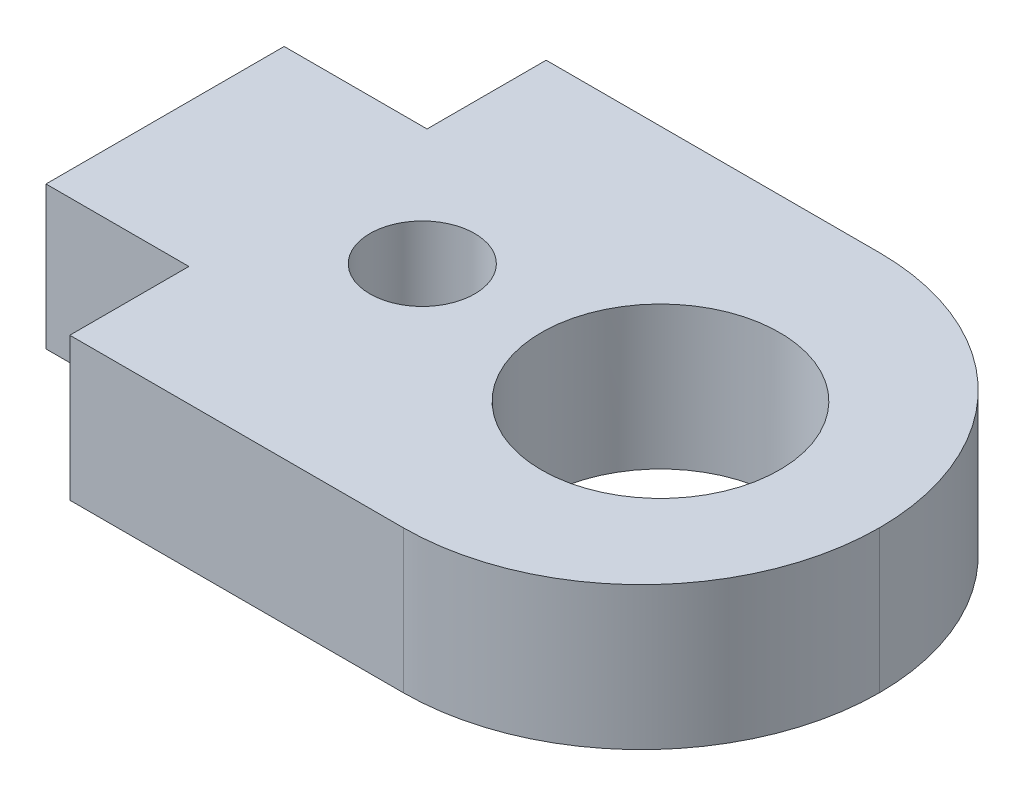
ISO-10303-21;
HEADER;
FILE_DESCRIPTION(('STEP AP214'),'2;1');
FILE_NAME('part.step','',(''),(''),'','','');
FILE_SCHEMA(('AUTOMOTIVE_DESIGN { 1 0 10303 214 1 1 1 1 }'));
ENDSEC;
DATA;
#1=APPLICATION_CONTEXT('core data for automotive mechanical design processes');
#2=APPLICATION_PROTOCOL_DEFINITION('international standard','automotive_design',2000,#1);
#3=PRODUCT_CONTEXT('',#1,'mechanical');
#4=PRODUCT('Part','Part','',(#3));
#5=PRODUCT_RELATED_PRODUCT_CATEGORY('part','',(#4));
#6=PRODUCT_DEFINITION_FORMATION('','',#4);
#7=PRODUCT_DEFINITION_CONTEXT('part definition',#1,'design');
#8=PRODUCT_DEFINITION('design','',#6,#7);
#9=PRODUCT_DEFINITION_SHAPE('','',#8);
#10=(LENGTH_UNIT() NAMED_UNIT(*) SI_UNIT(.MILLI.,.METRE.));
#11=(NAMED_UNIT(*) PLANE_ANGLE_UNIT() SI_UNIT($,.RADIAN.));
#12=(NAMED_UNIT(*) SI_UNIT($,.STERADIAN.) SOLID_ANGLE_UNIT());
#13=UNCERTAINTY_MEASURE_WITH_UNIT(LENGTH_MEASURE(1.E-05),#10,'distance_accuracy_value','');
#14=(GEOMETRIC_REPRESENTATION_CONTEXT(3) GLOBAL_UNCERTAINTY_ASSIGNED_CONTEXT((#13)) GLOBAL_UNIT_ASSIGNED_CONTEXT((#10,
#11,#12)) REPRESENTATION_CONTEXT('',''));
#15=CARTESIAN_POINT('',(0.,0.,0.));
#16=DIRECTION('',(0.,0.,1.));
#17=DIRECTION('',(1.,0.,0.));
#18=AXIS2_PLACEMENT_3D('',#15,#16,#17);
#19=CARTESIAN_POINT('',(-6.,3.,-5.));
#20=DIRECTION('',(0.,0.,1.));
#21=DIRECTION('',(1.,0.,0.));
#22=AXIS2_PLACEMENT_3D('',#19,#20,#21);
#23=PLANE('',#22);
#24=DIRECTION('',(-1.,0.,0.));
#25=VECTOR('',#24,1.);
#26=CARTESIAN_POINT('',(-6.,3.,-5.));
#27=LINE('',#26,#25);
#28=CARTESIAN_POINT('',(0.999999999999997,3.,-5.));
#29=VERTEX_POINT('',#28);
#30=CARTESIAN_POINT('',(-6.,3.,-5.));
#31=VERTEX_POINT('',#30);
#32=EDGE_CURVE('E107',#29,#31,#27,.T.);
#33=ORIENTED_EDGE('',*,*,#32,.F.);
#34=DIRECTION('',(0.,-1.,0.));
#35=VECTOR('',#34,1.);
#36=CARTESIAN_POINT('',(0.999999999999997,3.,-5.));
#37=LINE('',#36,#35);
#38=CARTESIAN_POINT('',(0.999999999999997,0.,-5.));
#39=VERTEX_POINT('',#38);
#40=EDGE_CURVE('E125',#29,#39,#37,.T.);
#41=ORIENTED_EDGE('',*,*,#40,.T.);
#42=DIRECTION('',(-1.,0.,0.));
#43=VECTOR('',#42,1.);
#44=CARTESIAN_POINT('',(-6.,0.,-5.));
#45=LINE('',#44,#43);
#46=CARTESIAN_POINT('',(-6.,0.,-5.));
#47=VERTEX_POINT('',#46);
#48=EDGE_CURVE('E122',#39,#47,#45,.T.);
#49=ORIENTED_EDGE('',*,*,#48,.T.);
#50=DIRECTION('',(0.,-1.,0.));
#51=VECTOR('',#50,1.);
#52=CARTESIAN_POINT('',(-6.,3.,-5.));
#53=LINE('',#52,#51);
#54=EDGE_CURVE('E120',#31,#47,#53,.T.);
#55=ORIENTED_EDGE('',*,*,#54,.F.);
#56=EDGE_LOOP('',(#33,#41,#49,#55));
#57=FACE_BOUND('',#56,.T.);
#58=ADVANCED_FACE('F37',(#57),#23,.F.);
#59=CARTESIAN_POINT('',(-6.,3.,-5.));
#60=DIRECTION('',(1.,0.,0.));
#61=DIRECTION('',(0.,0.,-1.));
#62=AXIS2_PLACEMENT_3D('',#59,#60,#61);
#63=PLANE('',#62);
#64=DIRECTION('',(0.,0.,1.));
#65=VECTOR('',#64,1.);
#66=CARTESIAN_POINT('',(-6.,0.,-5.));
#67=LINE('',#66,#65);
#68=CARTESIAN_POINT('',(-6.,0.,-2.5));
#69=VERTEX_POINT('',#68);
#70=EDGE_CURVE('E146',#47,#69,#67,.T.);
#71=ORIENTED_EDGE('',*,*,#70,.T.);
#72=DIRECTION('',(0.,-1.,0.));
#73=VECTOR('',#72,1.);
#74=CARTESIAN_POINT('',(-6.,3.,-2.5));
#75=LINE('',#74,#73);
#76=CARTESIAN_POINT('',(-6.,3.,-2.5));
#77=VERTEX_POINT('',#76);
#78=EDGE_CURVE('E126',#77,#69,#75,.T.);
#79=ORIENTED_EDGE('',*,*,#78,.F.);
#80=DIRECTION('',(0.,0.,1.));
#81=VECTOR('',#80,1.);
#82=CARTESIAN_POINT('',(-6.,3.,-5.));
#83=LINE('',#82,#81);
#84=EDGE_CURVE('E111',#31,#77,#83,.T.);
#85=ORIENTED_EDGE('',*,*,#84,.F.);
#86=ORIENTED_EDGE('',*,*,#54,.T.);
#87=EDGE_LOOP('',(#71,#79,#85,#86));
#88=FACE_BOUND('',#87,.T.);
#89=ADVANCED_FACE('F128',(#88),#63,.F.);
#90=CARTESIAN_POINT('',(-6.,3.,-2.5));
#91=DIRECTION('',(0.,0.,1.));
#92=DIRECTION('',(1.,0.,0.));
#93=AXIS2_PLACEMENT_3D('',#90,#91,#92);
#94=PLANE('',#93);
#95=DIRECTION('',(-1.,0.,0.));
#96=VECTOR('',#95,1.);
#97=CARTESIAN_POINT('',(-6.,0.,-2.5));
#98=LINE('',#97,#96);
#99=CARTESIAN_POINT('',(-9.,0.,-2.5));
#100=VERTEX_POINT('',#99);
#101=EDGE_CURVE('E149',#69,#100,#98,.T.);
#102=ORIENTED_EDGE('',*,*,#101,.T.);
#103=DIRECTION('',(0.,-1.,0.));
#104=VECTOR('',#103,1.);
#105=CARTESIAN_POINT('',(-9.,3.,-2.5));
#106=LINE('',#105,#104);
#107=CARTESIAN_POINT('',(-9.,3.,-2.5));
#108=VERTEX_POINT('',#107);
#109=EDGE_CURVE('E166',#108,#100,#106,.T.);
#110=ORIENTED_EDGE('',*,*,#109,.F.);
#111=DIRECTION('',(-1.,0.,0.));
#112=VECTOR('',#111,1.);
#113=CARTESIAN_POINT('',(-6.,3.,-2.5));
#114=LINE('',#113,#112);
#115=EDGE_CURVE('E131',#77,#108,#114,.T.);
#116=ORIENTED_EDGE('',*,*,#115,.F.);
#117=ORIENTED_EDGE('',*,*,#78,.T.);
#118=EDGE_LOOP('',(#102,#110,#116,#117));
#119=FACE_BOUND('',#118,.T.);
#120=ADVANCED_FACE('F219',(#119),#94,.F.);
#121=CARTESIAN_POINT('',(-9.,3.,-2.5));
#122=DIRECTION('',(1.,0.,0.));
#123=DIRECTION('',(0.,0.,-1.));
#124=AXIS2_PLACEMENT_3D('',#121,#122,#123);
#125=PLANE('',#124);
#126=DIRECTION('',(0.,0.,1.));
#127=VECTOR('',#126,1.);
#128=CARTESIAN_POINT('',(-9.,0.,-2.5));
#129=LINE('',#128,#127);
#130=CARTESIAN_POINT('',(-9.,0.,2.5));
#131=VERTEX_POINT('',#130);
#132=EDGE_CURVE('E151',#100,#131,#129,.T.);
#133=ORIENTED_EDGE('',*,*,#132,.T.);
#134=DIRECTION('',(0.,-1.,0.));
#135=VECTOR('',#134,1.);
#136=CARTESIAN_POINT('',(-9.,3.,2.5));
#137=LINE('',#136,#135);
#138=CARTESIAN_POINT('',(-9.,3.,2.5));
#139=VERTEX_POINT('',#138);
#140=EDGE_CURVE('E163',#139,#131,#137,.T.);
#141=ORIENTED_EDGE('',*,*,#140,.F.);
#142=DIRECTION('',(0.,0.,1.));
#143=VECTOR('',#142,1.);
#144=CARTESIAN_POINT('',(-9.,3.,-2.5));
#145=LINE('',#144,#143);
#146=EDGE_CURVE('E133',#108,#139,#145,.T.);
#147=ORIENTED_EDGE('',*,*,#146,.F.);
#148=ORIENTED_EDGE('',*,*,#109,.T.);
#149=EDGE_LOOP('',(#133,#141,#147,#148));
#150=FACE_BOUND('',#149,.T.);
#151=ADVANCED_FACE('F298',(#150),#125,.F.);
#152=CARTESIAN_POINT('',(-9.,3.,2.5));
#153=DIRECTION('',(0.,0.,-1.));
#154=DIRECTION('',(-1.,0.,0.));
#155=AXIS2_PLACEMENT_3D('',#152,#153,#154);
#156=PLANE('',#155);
#157=DIRECTION('',(1.,0.,0.));
#158=VECTOR('',#157,1.);
#159=CARTESIAN_POINT('',(-9.,0.,2.5));
#160=LINE('',#159,#158);
#161=CARTESIAN_POINT('',(-6.,0.,2.5));
#162=VERTEX_POINT('',#161);
#163=EDGE_CURVE('E153',#131,#162,#160,.T.);
#164=ORIENTED_EDGE('',*,*,#163,.T.);
#165=DIRECTION('',(0.,-1.,0.));
#166=VECTOR('',#165,1.);
#167=CARTESIAN_POINT('',(-6.,3.,2.5));
#168=LINE('',#167,#166);
#169=CARTESIAN_POINT('',(-6.,3.,2.5));
#170=VERTEX_POINT('',#169);
#171=EDGE_CURVE('E160',#170,#162,#168,.T.);
#172=ORIENTED_EDGE('',*,*,#171,.F.);
#173=DIRECTION('',(1.,0.,0.));
#174=VECTOR('',#173,1.);
#175=CARTESIAN_POINT('',(-9.,3.,2.5));
#176=LINE('',#175,#174);
#177=EDGE_CURVE('E138',#139,#170,#176,.T.);
#178=ORIENTED_EDGE('',*,*,#177,.F.);
#179=ORIENTED_EDGE('',*,*,#140,.T.);
#180=EDGE_LOOP('',(#164,#172,#178,#179));
#181=FACE_BOUND('',#180,.T.);
#182=ADVANCED_FACE('F289',(#181),#156,.F.);
#183=CARTESIAN_POINT('',(-6.,3.,2.5));
#184=DIRECTION('',(1.,0.,0.));
#185=DIRECTION('',(0.,0.,-1.));
#186=AXIS2_PLACEMENT_3D('',#183,#184,#185);
#187=PLANE('',#186);
#188=DIRECTION('',(0.,0.,1.));
#189=VECTOR('',#188,1.);
#190=CARTESIAN_POINT('',(-6.,0.,2.5));
#191=LINE('',#190,#189);
#192=CARTESIAN_POINT('',(-6.,0.,5.));
#193=VERTEX_POINT('',#192);
#194=EDGE_CURVE('E155',#162,#193,#191,.T.);
#195=ORIENTED_EDGE('',*,*,#194,.T.);
#196=DIRECTION('',(0.,-1.,0.));
#197=VECTOR('',#196,1.);
#198=CARTESIAN_POINT('',(-6.,3.,5.));
#199=LINE('',#198,#197);
#200=CARTESIAN_POINT('',(-6.,3.,5.));
#201=VERTEX_POINT('',#200);
#202=EDGE_CURVE('E144',#201,#193,#199,.T.);
#203=ORIENTED_EDGE('',*,*,#202,.F.);
#204=DIRECTION('',(0.,0.,1.));
#205=VECTOR('',#204,1.);
#206=CARTESIAN_POINT('',(-6.,3.,2.5));
#207=LINE('',#206,#205);
#208=EDGE_CURVE('E140',#170,#201,#207,.T.);
#209=ORIENTED_EDGE('',*,*,#208,.F.);
#210=ORIENTED_EDGE('',*,*,#171,.T.);
#211=EDGE_LOOP('',(#195,#203,#209,#210));
#212=FACE_BOUND('',#211,.T.);
#213=ADVANCED_FACE('F211',(#212),#187,.F.);
#214=CARTESIAN_POINT('',(-6.,3.,5.));
#215=DIRECTION('',(0.,0.,-1.));
#216=DIRECTION('',(-1.,0.,0.));
#217=AXIS2_PLACEMENT_3D('',#214,#215,#216);
#218=PLANE('',#217);
#219=DIRECTION('',(1.,0.,0.));
#220=VECTOR('',#219,1.);
#221=CARTESIAN_POINT('',(-6.,0.,5.));
#222=LINE('',#221,#220);
#223=CARTESIAN_POINT('',(0.999999999999997,0.,5.));
#224=VERTEX_POINT('',#223);
#225=EDGE_CURVE('E117',#193,#224,#222,.T.);
#226=ORIENTED_EDGE('',*,*,#225,.T.);
#227=DIRECTION('',(0.,-1.,0.));
#228=VECTOR('',#227,1.);
#229=CARTESIAN_POINT('',(0.999999999999997,3.,5.));
#230=LINE('',#229,#228);
#231=CARTESIAN_POINT('',(0.999999999999997,3.,5.));
#232=VERTEX_POINT('',#231);
#233=EDGE_CURVE('E11',#224,#232,#230,.F.);
#234=ORIENTED_EDGE('',*,*,#233,.T.);
#235=DIRECTION('',(1.,0.,0.));
#236=VECTOR('',#235,1.);
#237=CARTESIAN_POINT('',(-6.,3.,5.));
#238=LINE('',#237,#236);
#239=EDGE_CURVE('E142',#201,#232,#238,.T.);
#240=ORIENTED_EDGE('',*,*,#239,.F.);
#241=ORIENTED_EDGE('',*,*,#202,.T.);
#242=EDGE_LOOP('',(#226,#234,#240,#241));
#243=FACE_BOUND('',#242,.T.);
#244=ADVANCED_FACE('F202',(#243),#218,.F.);
#245=CARTESIAN_POINT('',(0.,3.,0.));
#246=DIRECTION('',(0.,-1.,0.));
#247=DIRECTION('',(0.,0.,-1.));
#248=AXIS2_PLACEMENT_3D('',#245,#246,#247);
#249=PLANE('',#248);
#250=CARTESIAN_POINT('',(1.4,3.,0.));
#251=DIRECTION('',(0.,1.,0.));
#252=DIRECTION('',(0.,0.,1.));
#253=AXIS2_PLACEMENT_3D('',#250,#251,#252);
#254=CIRCLE('',#253,2.5);
#255=CARTESIAN_POINT('',(1.4,3.,2.5));
#256=VERTEX_POINT('',#255);
#257=EDGE_CURVE('E173',#256,#256,#254,.T.);
#258=ORIENTED_EDGE('',*,*,#257,.F.);
#259=EDGE_LOOP('',(#258));
#260=FACE_BOUND('',#259,.T.);
#261=CARTESIAN_POINT('',(-3.6,3.,0.));
#262=DIRECTION('',(0.,1.,0.));
#263=DIRECTION('',(0.,0.,1.));
#264=AXIS2_PLACEMENT_3D('',#261,#262,#263);
#265=CIRCLE('',#264,1.1);
#266=CARTESIAN_POINT('',(-3.6,3.,1.1));
#267=VERTEX_POINT('',#266);
#268=EDGE_CURVE('E190',#267,#267,#265,.T.);
#269=ORIENTED_EDGE('',*,*,#268,.F.);
#270=EDGE_LOOP('',(#269));
#271=FACE_BOUND('',#270,.T.);
#272=CARTESIAN_POINT('',(0.999999999999997,3.,0.));
#273=DIRECTION('',(0.,-1.,0.));
#274=DIRECTION('',(0.,0.,-1.));
#275=AXIS2_PLACEMENT_3D('',#272,#273,#274);
#276=CIRCLE('',#275,5.);
#277=CARTESIAN_POINT('',(6.,3.,0.));
#278=VERTEX_POINT('',#277);
#279=EDGE_CURVE('E58',#232,#278,#276,.F.);
#280=ORIENTED_EDGE('',*,*,#279,.T.);
#281=CARTESIAN_POINT('',(0.999999999999997,3.,0.));
#282=DIRECTION('',(0.,-1.,0.));
#283=DIRECTION('',(0.,0.,-1.));
#284=AXIS2_PLACEMENT_3D('',#281,#282,#283);
#285=CIRCLE('',#284,5.);
#286=EDGE_CURVE('E46',#278,#29,#285,.F.);
#287=ORIENTED_EDGE('',*,*,#286,.T.);
#288=ORIENTED_EDGE('',*,*,#32,.T.);
#289=ORIENTED_EDGE('',*,*,#84,.T.);
#290=ORIENTED_EDGE('',*,*,#115,.T.);
#291=ORIENTED_EDGE('',*,*,#146,.T.);
#292=ORIENTED_EDGE('',*,*,#177,.T.);
#293=ORIENTED_EDGE('',*,*,#208,.T.);
#294=ORIENTED_EDGE('',*,*,#239,.T.);
#295=EDGE_LOOP('',(#280,#287,#288,#289,#290,#291,#292,#293,#294));
#296=FACE_BOUND('',#295,.T.);
#297=ADVANCED_FACE('F109',(#260,#271,#296),#249,.F.);
#298=CARTESIAN_POINT('',(0.,0.,0.));
#299=DIRECTION('',(0.,-1.,0.));
#300=DIRECTION('',(0.,0.,-1.));
#301=AXIS2_PLACEMENT_3D('',#298,#299,#300);
#302=PLANE('',#301);
#303=CARTESIAN_POINT('',(1.4,0.,0.));
#304=DIRECTION('',(0.,-1.,0.));
#305=DIRECTION('',(0.,0.,-1.));
#306=AXIS2_PLACEMENT_3D('',#303,#304,#305);
#307=CIRCLE('',#306,2.5);
#308=CARTESIAN_POINT('',(1.4,0.,-2.5));
#309=VERTEX_POINT('',#308);
#310=EDGE_CURVE('E147',#309,#309,#307,.T.);
#311=ORIENTED_EDGE('',*,*,#310,.F.);
#312=EDGE_LOOP('',(#311));
#313=FACE_BOUND('',#312,.T.);
#314=CARTESIAN_POINT('',(-3.6,0.,0.));
#315=DIRECTION('',(0.,-1.,0.));
#316=DIRECTION('',(0.,0.,-1.));
#317=AXIS2_PLACEMENT_3D('',#314,#315,#316);
#318=CIRCLE('',#317,1.1);
#319=CARTESIAN_POINT('',(-3.6,0.,-1.1));
#320=VERTEX_POINT('',#319);
#321=EDGE_CURVE('E170',#320,#320,#318,.T.);
#322=ORIENTED_EDGE('',*,*,#321,.F.);
#323=EDGE_LOOP('',(#322));
#324=FACE_BOUND('',#323,.T.);
#325=ORIENTED_EDGE('',*,*,#48,.F.);
#326=CARTESIAN_POINT('',(0.999999999999997,0.,0.));
#327=DIRECTION('',(0.,-1.,0.));
#328=DIRECTION('',(0.,0.,-1.));
#329=AXIS2_PLACEMENT_3D('',#326,#327,#328);
#330=CIRCLE('',#329,5.);
#331=CARTESIAN_POINT('',(6.,0.,0.));
#332=VERTEX_POINT('',#331);
#333=EDGE_CURVE('E179',#39,#332,#330,.T.);
#334=ORIENTED_EDGE('',*,*,#333,.T.);
#335=CARTESIAN_POINT('',(0.999999999999997,0.,0.));
#336=DIRECTION('',(0.,-1.,0.));
#337=DIRECTION('',(0.,0.,-1.));
#338=AXIS2_PLACEMENT_3D('',#335,#336,#337);
#339=CIRCLE('',#338,5.);
#340=EDGE_CURVE('E177',#332,#224,#339,.T.);
#341=ORIENTED_EDGE('',*,*,#340,.T.);
#342=ORIENTED_EDGE('',*,*,#225,.F.);
#343=ORIENTED_EDGE('',*,*,#194,.F.);
#344=ORIENTED_EDGE('',*,*,#163,.F.);
#345=ORIENTED_EDGE('',*,*,#132,.F.);
#346=ORIENTED_EDGE('',*,*,#101,.F.);
#347=ORIENTED_EDGE('',*,*,#70,.F.);
#348=EDGE_LOOP('',(#325,#334,#341,#342,#343,#344,#345,#346,#347));
#349=FACE_BOUND('',#348,.T.);
#350=ADVANCED_FACE('F184',(#313,#324,#349),#302,.T.);
#351=CARTESIAN_POINT('',(-3.6,-7.,0.));
#352=DIRECTION('',(0.,1.,0.));
#353=DIRECTION('',(0.,0.,1.));
#354=AXIS2_PLACEMENT_3D('',#351,#352,#353);
#355=CYLINDRICAL_SURFACE('',#354,1.1);
#356=ORIENTED_EDGE('',*,*,#321,.T.);
#357=EDGE_LOOP('',(#356));
#358=FACE_BOUND('',#357,.T.);
#359=ORIENTED_EDGE('',*,*,#268,.T.);
#360=EDGE_LOOP('',(#359));
#361=FACE_BOUND('',#360,.T.);
#362=ADVANCED_FACE('F208',(#358,#361),#355,.F.);
#363=CARTESIAN_POINT('',(1.4,-7.,0.));
#364=DIRECTION('',(0.,1.,0.));
#365=DIRECTION('',(0.,0.,1.));
#366=AXIS2_PLACEMENT_3D('',#363,#364,#365);
#367=CYLINDRICAL_SURFACE('',#366,2.5);
#368=ORIENTED_EDGE('',*,*,#310,.T.);
#369=EDGE_LOOP('',(#368));
#370=FACE_BOUND('',#369,.T.);
#371=ORIENTED_EDGE('',*,*,#257,.T.);
#372=EDGE_LOOP('',(#371));
#373=FACE_BOUND('',#372,.T.);
#374=ADVANCED_FACE('F198',(#370,#373),#367,.F.);
#375=CARTESIAN_POINT('',(0.999999999999997,3.,0.));
#376=DIRECTION('',(0.,-1.,0.));
#377=DIRECTION('',(0.,0.,-1.));
#378=AXIS2_PLACEMENT_3D('',#375,#376,#377);
#379=CYLINDRICAL_SURFACE('',#378,5.);
#380=DIRECTION('',(0.,-1.,0.));
#381=VECTOR('',#380,1.);
#382=CARTESIAN_POINT('',(6.,3.,0.));
#383=LINE('',#382,#381);
#384=EDGE_CURVE('E41',#278,#332,#383,.T.);
#385=ORIENTED_EDGE('',*,*,#384,.F.);
#386=ORIENTED_EDGE('',*,*,#279,.F.);
#387=ORIENTED_EDGE('',*,*,#233,.F.);
#388=ORIENTED_EDGE('',*,*,#340,.F.);
#389=EDGE_LOOP('',(#385,#386,#387,#388));
#390=FACE_BOUND('',#389,.T.);
#391=ADVANCED_FACE('F39',(#390),#379,.T.);
#392=CARTESIAN_POINT('',(0.999999999999997,3.,0.));
#393=DIRECTION('',(0.,-1.,0.));
#394=DIRECTION('',(0.,0.,-1.));
#395=AXIS2_PLACEMENT_3D('',#392,#393,#394);
#396=CYLINDRICAL_SURFACE('',#395,5.);
#397=ORIENTED_EDGE('',*,*,#286,.F.);
#398=ORIENTED_EDGE('',*,*,#384,.T.);
#399=ORIENTED_EDGE('',*,*,#333,.F.);
#400=ORIENTED_EDGE('',*,*,#40,.F.);
#401=EDGE_LOOP('',(#397,#398,#399,#400));
#402=FACE_BOUND('',#401,.T.);
#403=ADVANCED_FACE('F189',(#402),#396,.T.);
#404=CLOSED_SHELL('',(#58,#89,#120,#151,#182,#213,#244,#297,#350,#362,#374,#391,#403));
#405=MANIFOLD_SOLID_BREP('B2',#404);
#406=ADVANCED_BREP_SHAPE_REPRESENTATION('',(#18,#405),#14);
#407=SHAPE_DEFINITION_REPRESENTATION(#9,#406);
ENDSEC;
END-ISO-10303-21;
